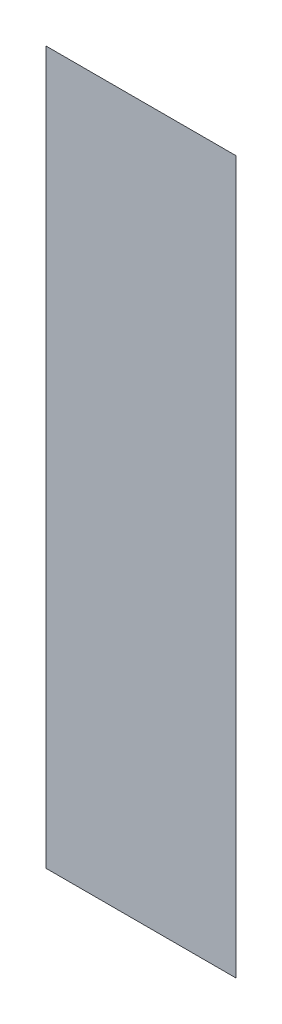
ISO-10303-21;
HEADER;
FILE_DESCRIPTION(('STEP AP214'),'2;1');
FILE_NAME('part.step','',(''),(''),'','','');
FILE_SCHEMA(('AUTOMOTIVE_DESIGN { 1 0 10303 214 1 1 1 1 }'));
ENDSEC;
DATA;
#1=APPLICATION_CONTEXT('core data for automotive mechanical design processes');
#2=APPLICATION_PROTOCOL_DEFINITION('international standard','automotive_design',2000,#1);
#3=PRODUCT_CONTEXT('',#1,'mechanical');
#4=PRODUCT('Part','Part','',(#3));
#5=PRODUCT_RELATED_PRODUCT_CATEGORY('part','',(#4));
#6=PRODUCT_DEFINITION_FORMATION('','',#4);
#7=PRODUCT_DEFINITION_CONTEXT('part definition',#1,'design');
#8=PRODUCT_DEFINITION('design','',#6,#7);
#9=PRODUCT_DEFINITION_SHAPE('','',#8);
#10=(LENGTH_UNIT() NAMED_UNIT(*) SI_UNIT(.MILLI.,.METRE.));
#11=(NAMED_UNIT(*) PLANE_ANGLE_UNIT() SI_UNIT($,.RADIAN.));
#12=(NAMED_UNIT(*) SI_UNIT($,.STERADIAN.) SOLID_ANGLE_UNIT());
#13=UNCERTAINTY_MEASURE_WITH_UNIT(LENGTH_MEASURE(1.E-05),#10,'distance_accuracy_value','');
#14=(GEOMETRIC_REPRESENTATION_CONTEXT(3) GLOBAL_UNCERTAINTY_ASSIGNED_CONTEXT((#13)) GLOBAL_UNIT_ASSIGNED_CONTEXT((#10,
#11,#12)) REPRESENTATION_CONTEXT('',''));
#15=CARTESIAN_POINT('',(0.,0.,0.));
#16=DIRECTION('',(0.,0.,1.));
#17=DIRECTION('',(1.,0.,0.));
#18=AXIS2_PLACEMENT_3D('',#15,#16,#17);
#19=CARTESIAN_POINT('',(0.169413095143196,-0.596348005406387,0.0889425196850394));
#20=DIRECTION('',(0.,0.,1.));
#21=DIRECTION('',(0.,-1.,0.));
#22=AXIS2_PLACEMENT_3D('',#19,#20,#21);
#23=PLANE('',#22);
#24=CARTESIAN_POINT('',(0.158830417977842,-0.598237769185914,0.0889425196850394));
#25=DIRECTION('',(1.,0.,0.));
#26=VECTOR('',#25,1.);
#27=LINE('',#24,#26);
#28=CARTESIAN_POINT('',(0.158830417977842,-0.598237769185914,0.0890685039370079));
#29=VERTEX_POINT('',#28);
#30=CARTESIAN_POINT('',(0.168909158135323,-0.598237769185914,0.0890685039370079));
#31=VERTEX_POINT('',#30);
#32=EDGE_CURVE('E50',#29,#31,#27,.T.);
#33=ORIENTED_EDGE('',*,*,#32,.T.);
#34=CARTESIAN_POINT('',(0.168909158135323,-0.598237769185914,0.0889425196850394));
#35=DIRECTION('',(0.,-1.,0.));
#36=VECTOR('',#35,1.);
#37=LINE('',#34,#36);
#38=CARTESIAN_POINT('',(0.168909158135323,-0.636033044776465,0.0890685039370079));
#39=VERTEX_POINT('',#38);
#40=EDGE_CURVE('E28',#31,#39,#37,.T.);
#41=ORIENTED_EDGE('',*,*,#40,.T.);
#42=CARTESIAN_POINT('',(0.168909158135323,-0.636033044776465,0.0889425196850394));
#43=DIRECTION('',(-1.,0.,0.));
#44=VECTOR('',#43,1.);
#45=LINE('',#42,#44);
#46=CARTESIAN_POINT('',(0.158830417977842,-0.636033044776465,0.0890685039370079));
#47=VERTEX_POINT('',#46);
#48=EDGE_CURVE('E11',#39,#47,#45,.T.);
#49=ORIENTED_EDGE('',*,*,#48,.T.);
#50=CARTESIAN_POINT('',(0.158830417977842,-0.636033044776465,0.0889425196850394));
#51=DIRECTION('',(0.,1.,0.));
#52=VECTOR('',#51,1.);
#53=LINE('',#50,#52);
#54=EDGE_CURVE('E41',#47,#29,#53,.T.);
#55=ORIENTED_EDGE('',*,*,#54,.T.);
#56=EDGE_LOOP('',(#33,#41,#49,#55));
#57=FACE_BOUND('',#56,.T.);
#58=ADVANCED_FACE('F17',(#57),#23,.F.);
#59=CARTESIAN_POINT('',(0.169413095143196,-0.596348005406387,0.0891944881889764));
#60=DIRECTION('',(0.,0.,1.));
#61=DIRECTION('',(0.,-1.,0.));
#62=AXIS2_PLACEMENT_3D('',#59,#60,#61);
#63=PLANE('',#62);
#64=ORIENTED_EDGE('',*,*,#40,.F.);
#65=ORIENTED_EDGE('',*,*,#32,.F.);
#66=ORIENTED_EDGE('',*,*,#54,.F.);
#67=ORIENTED_EDGE('',*,*,#48,.F.);
#68=EDGE_LOOP('',(#64,#65,#66,#67));
#69=FACE_BOUND('',#68,.T.);
#70=ADVANCED_FACE('F49',(#69),#63,.T.);
#71=CLOSED_SHELL('',(#58,#70));
#72=MANIFOLD_SOLID_BREP('B1',#71);
#73=ADVANCED_BREP_SHAPE_REPRESENTATION('',(#18,#72),#14);
#74=SHAPE_DEFINITION_REPRESENTATION(#9,#73);
ENDSEC;
END-ISO-10303-21;
